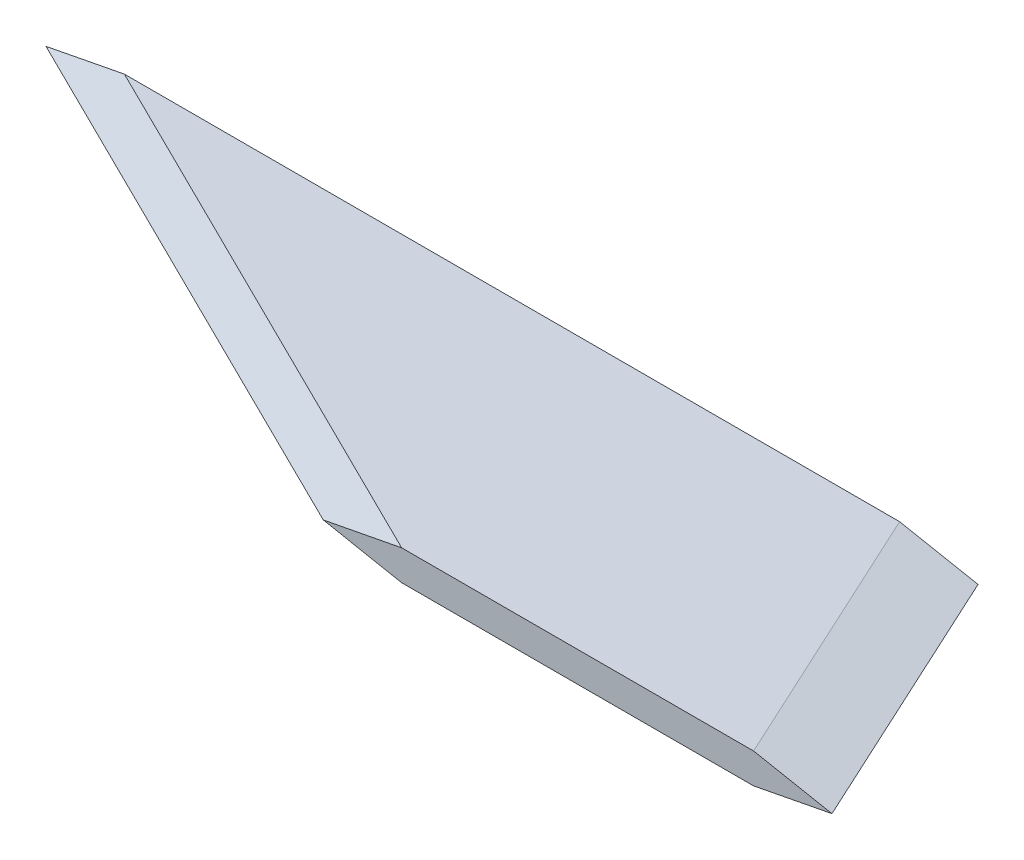
ISO-10303-21;
HEADER;
FILE_DESCRIPTION(('STEP AP214'),'2;1');
FILE_NAME('part.step','',(''),(''),'','','');
FILE_SCHEMA(('AUTOMOTIVE_DESIGN { 1 0 10303 214 1 1 1 1 }'));
ENDSEC;
DATA;
#1=APPLICATION_CONTEXT('core data for automotive mechanical design processes');
#2=APPLICATION_PROTOCOL_DEFINITION('international standard','automotive_design',2000,#1);
#3=PRODUCT_CONTEXT('',#1,'mechanical');
#4=PRODUCT('Part','Part','',(#3));
#5=PRODUCT_RELATED_PRODUCT_CATEGORY('part','',(#4));
#6=PRODUCT_DEFINITION_FORMATION('','',#4);
#7=PRODUCT_DEFINITION_CONTEXT('part definition',#1,'design');
#8=PRODUCT_DEFINITION('design','',#6,#7);
#9=PRODUCT_DEFINITION_SHAPE('','',#8);
#10=(LENGTH_UNIT() NAMED_UNIT(*) SI_UNIT(.MILLI.,.METRE.));
#11=(NAMED_UNIT(*) PLANE_ANGLE_UNIT() SI_UNIT($,.RADIAN.));
#12=(NAMED_UNIT(*) SI_UNIT($,.STERADIAN.) SOLID_ANGLE_UNIT());
#13=UNCERTAINTY_MEASURE_WITH_UNIT(LENGTH_MEASURE(1.E-05),#10,'distance_accuracy_value','');
#14=(GEOMETRIC_REPRESENTATION_CONTEXT(3) GLOBAL_UNCERTAINTY_ASSIGNED_CONTEXT((#13)) GLOBAL_UNIT_ASSIGNED_CONTEXT((#10,
#11,#12)) REPRESENTATION_CONTEXT('',''));
#15=CARTESIAN_POINT('',(0.,0.,0.));
#16=DIRECTION('',(0.,0.,1.));
#17=DIRECTION('',(1.,0.,0.));
#18=AXIS2_PLACEMENT_3D('',#15,#16,#17);
#19=CARTESIAN_POINT('',(0.,0.,43.9778671264648));
#20=DIRECTION('',(0.,0.,-1.));
#21=DIRECTION('',(-1.,0.,0.));
#22=AXIS2_PLACEMENT_3D('',#19,#20,#21);
#23=PLANE('',#22);
#24=DIRECTION('',(-0.981771529020811,-0.190064896296341,0.));
#25=VECTOR('',#24,1.);
#26=CARTESIAN_POINT('',(171.319976806641,-0.0102802654728293,43.9778671264648));
#27=LINE('',#26,#25);
#28=CARTESIAN_POINT('',(171.319976806641,-0.0102802654728293,43.9778671264648));
#29=VERTEX_POINT('',#28);
#30=CARTESIAN_POINT('',(158.620010375977,-2.46891522407532,43.9778671264648));
#31=VERTEX_POINT('',#30);
#32=EDGE_CURVE('E390',#29,#31,#27,.T.);
#33=ORIENTED_EDGE('',*,*,#32,.F.);
#34=DIRECTION('',(0.982035942360966,-0.188693953032971,0.));
#35=VECTOR('',#34,1.);
#36=CARTESIAN_POINT('',(158.619995117188,2.42996621131897,43.9778671264648));
#37=LINE('',#36,#35);
#38=CARTESIAN_POINT('',(158.619995117188,2.42996621131897,43.9778671264648));
#39=VERTEX_POINT('',#38);
#40=EDGE_CURVE('E13',#39,#29,#37,.T.);
#41=ORIENTED_EDGE('',*,*,#40,.F.);
#42=DIRECTION('',(0.999999999999918,4.05589854425458E-07,0.));
#43=VECTOR('',#42,1.);
#44=CARTESIAN_POINT('',(101.600318908691,2.4299430847168,43.9778671264648));
#45=LINE('',#44,#43);
#46=CARTESIAN_POINT('',(101.600318908691,2.4299430847168,43.9778671264648));
#47=VERTEX_POINT('',#46);
#48=EDGE_CURVE('E132',#47,#39,#45,.T.);
#49=ORIENTED_EDGE('',*,*,#48,.F.);
#50=DIRECTION('',(0.982037218923604,0.188687309188493,0.));
#51=VECTOR('',#50,1.);
#52=CARTESIAN_POINT('',(88.8999938964844,-0.0102802654728293,43.9778671264648));
#53=LINE('',#52,#51);
#54=CARTESIAN_POINT('',(88.8999938964844,-0.0102802654728293,43.9778671264648));
#55=VERTEX_POINT('',#54);
#56=EDGE_CURVE('E447',#55,#47,#53,.T.);
#57=ORIENTED_EDGE('',*,*,#56,.F.);
#58=DIRECTION('',(-0.981772530361559,0.190059723843483,0.));
#59=VECTOR('',#58,1.);
#60=CARTESIAN_POINT('',(101.600318908691,-2.46891522407532,43.9778671264648));
#61=LINE('',#60,#59);
#62=CARTESIAN_POINT('',(101.600318908691,-2.46891522407532,43.9778671264648));
#63=VERTEX_POINT('',#62);
#64=EDGE_CURVE('E279',#63,#55,#61,.T.);
#65=ORIENTED_EDGE('',*,*,#64,.F.);
#66=DIRECTION('',(-1.,0.,0.));
#67=VECTOR('',#66,1.);
#68=CARTESIAN_POINT('',(158.620010375977,-2.46891522407532,43.9778671264648));
#69=LINE('',#68,#67);
#70=EDGE_CURVE('E388',#31,#63,#69,.T.);
#71=ORIENTED_EDGE('',*,*,#70,.F.);
#72=EDGE_LOOP('',(#33,#41,#49,#57,#65,#71));
#73=FACE_BOUND('',#72,.T.);
#74=ADVANCED_FACE('F121',(#73),#23,.F.);
#75=CARTESIAN_POINT('',(2.91023767950519E-11,-1.01686476964534E-10,-5.39078256787366E-05));
#76=DIRECTION('',(5.3985439829147E-07,-1.8863026969468E-06,-0.999999999998075));
#77=DIRECTION('',(0.,0.999999999998221,-1.88630269694707E-06));
#78=AXIS2_PLACEMENT_3D('',#75,#76,#77);
#79=PLANE('',#78);
#80=DIRECTION('',(0.981802551010805,-0.18990458348309,8.88247953405389E-07));
#81=VECTOR('',#80,1.);
#82=CARTESIAN_POINT('',(138.299987792962,2.45649242403471,1.61203427303919E-05));
#83=LINE('',#82,#81);
#84=CARTESIAN_POINT('',(138.299987792962,2.45649242403471,1.61203427303919E-05));
#85=VERTEX_POINT('',#84);
#86=CARTESIAN_POINT('',(150.999999999985,5.20811692383827E-11,2.76101884631185E-05));
#87=VERTEX_POINT('',#86);
#88=EDGE_CURVE('E184',#85,#87,#83,.T.);
#89=ORIENTED_EDGE('',*,*,#88,.T.);
#90=DIRECTION('',(-0.981534850257778,-0.191283396376719,-1.69067519521798E-07));
#91=VECTOR('',#90,1.);
#92=CARTESIAN_POINT('',(150.999999999985,5.2081172934185E-11,2.76101884631185E-05));
#93=LINE('',#92,#91);
#94=CARTESIAN_POINT('',(138.299987792957,-2.47500276561449,2.54226354066225E-05));
#95=VERTEX_POINT('',#94);
#96=EDGE_CURVE('E202',#87,#95,#93,.T.);
#97=ORIENTED_EDGE('',*,*,#96,.T.);
#98=DIRECTION('',(-0.999999999999854,-1.89920538358445E-09,-5.39854394709954E-07));
#99=VECTOR('',#98,1.);
#100=CARTESIAN_POINT('',(138.299987792957,-2.47500276561449,2.54226354066225E-05));
#101=LINE('',#100,#99);
#102=CARTESIAN_POINT('',(12.7003250122299,-2.47500300415404,-4.23828945196512E-05));
#103=VERTEX_POINT('',#102);
#104=EDGE_CURVE('E352',#95,#103,#101,.T.);
#105=ORIENTED_EDGE('',*,*,#104,.T.);
#106=DIRECTION('',(-0.981535731332595,0.191278875249188,-8.90696239893344E-07));
#107=VECTOR('',#106,1.);
#108=CARTESIAN_POINT('',(12.7003250122299,-2.47500300415404,-4.23828945196512E-05));
#109=LINE('',#108,#107);
#110=CARTESIAN_POINT('',(2.91017210329869E-11,-1.01686020714808E-10,-5.39078256787366E-05));
#111=VERTEX_POINT('',#110);
#112=EDGE_CURVE('E354',#103,#111,#109,.T.);
#113=ORIENTED_EDGE('',*,*,#112,.T.);
#114=DIRECTION('',(-0.981803742332193,-0.189898424275902,-1.71825158699809E-07));
#115=VECTOR('',#114,1.);
#116=CARTESIAN_POINT('',(12.7003211975377,2.45646953573014,-5.16851465309501E-05));
#117=LINE('',#116,#115);
#118=CARTESIAN_POINT('',(12.7003211975377,2.45646953573014,-5.16851465309501E-05));
#119=VERTEX_POINT('',#118);
#120=EDGE_CURVE('E187',#119,#111,#117,.T.);
#121=ORIENTED_EDGE('',*,*,#120,.F.);
#122=DIRECTION('',(-0.999999999999838,-1.82232208019667E-07,-5.39854054547316E-07));
#123=VECTOR('',#122,1.);
#124=CARTESIAN_POINT('',(138.299987792962,2.45649242403471,1.61203427303919E-05));
#125=LINE('',#124,#123);
#126=EDGE_CURVE('E179',#85,#119,#125,.T.);
#127=ORIENTED_EDGE('',*,*,#126,.F.);
#128=EDGE_LOOP('',(#89,#97,#105,#113,#121,#127));
#129=FACE_BOUND('',#128,.T.);
#130=ADVANCED_FACE('F182',(#129),#79,.T.);
#131=CARTESIAN_POINT('',(12.7003211975377,2.45646953573014,-5.16851465309501E-05));
#132=CARTESIAN_POINT('',(42.3336537679223,2.44762738539236,14.6592545853906));
#133=CARTESIAN_POINT('',(71.9669863383068,2.43878523505458,29.3185608559277));
#134=CARTESIAN_POINT('',(101.600318908691,2.4299430847168,43.9778671264648));
#135=CARTESIAN_POINT('',(11.6419610977453,2.25176374107749,-5.18703697932657E-05));
#136=CARTESIAN_POINT('',(41.275293562166,2.24337287367421,14.6592544619084));
#137=CARTESIAN_POINT('',(70.9086260265867,2.23498200627094,29.3185607941866));
#138=CARTESIAN_POINT('',(100.541958491007,2.22659113886766,43.9778671264648));
#139=CARTESIAN_POINT('',(9.52524089816053,1.84235215177219,-5.22408163178967E-05));
#140=CARTESIAN_POINT('',(39.1585731506536,1.83486385023792,14.6592542149441));
#141=CARTESIAN_POINT('',(68.7919054031466,1.82737554870366,29.3185606707045));
#142=CARTESIAN_POINT('',(98.4252376556396,1.81988724716939,43.9778671264649));
#143=CARTESIAN_POINT('',(6.35016059878339,1.22823476781423,-5.27964861048434E-05));
#144=CARTESIAN_POINT('',(35.9834925333849,1.22210031508348,14.6592538444975));
#145=CARTESIAN_POINT('',(65.6168244679864,1.21596586235273,29.3185604854812));
#146=CARTESIAN_POINT('',(95.250156402588,1.20983140962198,43.9778671264648));
#147=CARTESIAN_POINT('',(3.17508029940624,0.614117383856271,-5.33521558917899E-05));
#148=CARTESIAN_POINT('',(32.8084119161162,0.609336779929039,14.659253474051));
#149=CARTESIAN_POINT('',(62.4417435328262,0.604556176001808,29.3185603002579));
#150=CARTESIAN_POINT('',(92.0750751495362,0.599775572074577,43.9778671264649));
#151=CARTESIAN_POINT('',(1.05836009982148,0.204705794550966,-5.3722602416421E-05));
#152=CARTESIAN_POINT('',(30.6916915046037,0.200827756492746,14.6592532270867));
#153=CARTESIAN_POINT('',(60.325022909386,0.196949718434526,29.3185601767757));
#154=CARTESIAN_POINT('',(89.9583543141683,0.193071680376306,43.9778671264648));
#155=CARTESIAN_POINT('',(2.91017210329869E-11,-1.01686454395677E-10,-5.39078256787366E-05));
#156=CARTESIAN_POINT('',(29.6333312988475,-0.00342675522540075,14.6592531036045));
#157=CARTESIAN_POINT('',(59.2666625976659,-0.00685351034911505,29.3185601150347));
#158=CARTESIAN_POINT('',(88.8999938964844,-0.0102802654728293,43.9778671264648));
#159=B_SPLINE_SURFACE_WITH_KNOTS('',3,3,((#131,#132,#133,#134),(#135,#136,#137,#138),(#139,#140,
#141,#142),(#143,#144,#145,#146),(#147,#148,#149,#150),(#151,#152,#153,#154),(#155,#156,#157,
#158)),.UNSPECIFIED.,.F.,.F.,.F.,(4,1,1,1,4),(4,4),(0.939644034283522,0.954733025712642,
0.969822017141761,0.98491100857088,1.),(0.,1.),.UNSPECIFIED.);
#160=CARTESIAN_POINT('',(2.91017210329869E-11,-1.01686020714808E-10,-5.39078256787366E-05));
#161=CARTESIAN_POINT('',(29.6333312988475,-0.00342675522540011,14.6592531036045));
#162=CARTESIAN_POINT('',(59.2666625976659,-0.00685351034911419,29.3185601150347));
#163=CARTESIAN_POINT('',(88.8999938964844,-0.0102802654728283,43.9778671264648));
#164=B_SPLINE_CURVE_WITH_KNOTS('',3,(#160,#161,#162,#163),.UNSPECIFIED.,.F.,.F.,(4,4),(0.,1.),.UNSPECIFIED.);
#165=EDGE_CURVE('E210',#111,#55,#164,.T.);
#166=CARTESIAN_POINT('',(12.7003211975377,2.45646953573014,-5.16851465309501E-05));
#167=CARTESIAN_POINT('',(42.3336537679223,2.44762738539236,14.6592545853906));
#168=CARTESIAN_POINT('',(71.9669863383068,2.43878523505458,29.3185608559277));
#169=CARTESIAN_POINT('',(101.600318908691,2.4299430847168,43.9778671264648));
#170=B_SPLINE_CURVE_WITH_KNOTS('',3,(#166,#167,#168,#169),.UNSPECIFIED.,.F.,.F.,(4,4),(0.,1.),.UNSPECIFIED.);
#171=EDGE_CURVE('E208',#119,#47,#170,.T.);
#172=ORIENTED_EDGE('',*,*,#120,.T.);
#173=ORIENTED_EDGE('',*,*,#165,.T.);
#174=ORIENTED_EDGE('',*,*,#56,.T.);
#175=ORIENTED_EDGE('',*,*,#171,.F.);
#176=EDGE_LOOP('',(#172,#173,#174,#175));
#177=FACE_BOUND('',#176,.T.);
#178=ADVANCED_FACE('F242',(#177),#159,.T.);
#179=CARTESIAN_POINT('',(138.299987792962,2.45649242403471,1.61203427303919E-05));
#180=CARTESIAN_POINT('',(145.073323567704,2.44765035312947,14.6592997890501));
#181=CARTESIAN_POINT('',(151.846659342446,2.43880828222422,29.3185834577575));
#182=CARTESIAN_POINT('',(158.619995117188,2.42996621131897,43.9778671264648));
#183=CARTESIAN_POINT('',(127.83334891001,2.456490516676,1.04698852919467E-05));
#184=CARTESIAN_POINT('',(136.511684417722,2.44764843915137,14.6592960220785));
#185=CARTESIAN_POINT('',(145.190019925434,2.43880636162675,29.3185815742717));
#186=CARTESIAN_POINT('',(153.868355433146,2.42996428410212,43.9778671264648));
#187=CARTESIAN_POINT('',(106.900071144106,2.45648670195857,-8.31029584943639E-07));
#188=CARTESIAN_POINT('',(119.388406117759,2.44764461119519,14.6592884881352));
#189=CARTESIAN_POINT('',(131.876741091411,2.43880252043181,29.3185778073));
#190=CARTESIAN_POINT('',(144.365076065064,2.42996042966843,43.9778671264649));
#191=CARTESIAN_POINT('',(75.5001544952498,2.45648097988243,-1.77824019002792E-05));
#192=CARTESIAN_POINT('',(93.703488667813,2.44763886926091,14.6592771872203));
#193=CARTESIAN_POINT('',(111.906822840376,2.4387967586394,29.3185721568426));
#194=CARTESIAN_POINT('',(130.110157012939,2.42995464801788,43.9778671264648));
#195=CARTESIAN_POINT('',(44.1002378463938,2.45647525780629,-3.47337742156146E-05));
#196=CARTESIAN_POINT('',(68.0185712178676,2.44763312732664,14.6592658863055));
#197=CARTESIAN_POINT('',(91.9369045893415,2.43879099684699,29.3185665063851));
#198=CARTESIAN_POINT('',(115.855237960815,2.42994886636734,43.9778671264648));
#199=CARTESIAN_POINT('',(23.1669600804897,2.45647144308886,-4.6034689092505E-05));
#200=CARTESIAN_POINT('',(50.895292917904,2.44762929937045,14.6592583523622));
#201=CARTESIAN_POINT('',(78.6236257553184,2.43878715565205,29.3185627394135));
#202=CARTESIAN_POINT('',(106.351958592733,2.42994501193364,43.9778671264649));
#203=CARTESIAN_POINT('',(12.7003211975377,2.45646953573014,-5.16851465309501E-05));
#204=CARTESIAN_POINT('',(42.3336537679223,2.44762738539236,14.6592545853906));
#205=CARTESIAN_POINT('',(71.9669863383068,2.43878523505458,29.3185608559277));
#206=CARTESIAN_POINT('',(101.600318908691,2.4299430847168,43.9778671264648));
#207=B_SPLINE_SURFACE_WITH_KNOTS('',3,3,((#179,#180,#181,#182),(#183,#184,#185,#186),(#187,#188,
#189,#190),(#191,#192,#193,#194),(#195,#196,#197,#198),(#199,#200,#201,#202),(#203,#204,#205,
#206)),.UNSPECIFIED.,.F.,.F.,.F.,(4,1,1,1,4),(4,4),(0.560370804845663,0.655189112205128,
0.750007419564592,0.844825726924057,0.939644034283522),(0.,1.),.UNSPECIFIED.);
#208=CARTESIAN_POINT('',(138.299987792962,2.45649242403471,1.61203427303919E-05));
#209=CARTESIAN_POINT('',(145.073323567704,2.44765035312947,14.6592997890501));
#210=CARTESIAN_POINT('',(151.846659342446,2.43880828222422,29.3185834577575));
#211=CARTESIAN_POINT('',(158.619995117188,2.42996621131897,43.9778671264648));
#212=B_SPLINE_CURVE_WITH_KNOTS('',3,(#208,#209,#210,#211),.UNSPECIFIED.,.F.,.F.,(4,4),(0.,1.),.UNSPECIFIED.);
#213=EDGE_CURVE('E201',#85,#39,#212,.T.);
#214=ORIENTED_EDGE('',*,*,#126,.T.);
#215=ORIENTED_EDGE('',*,*,#171,.T.);
#216=ORIENTED_EDGE('',*,*,#48,.T.);
#217=ORIENTED_EDGE('',*,*,#213,.F.);
#218=EDGE_LOOP('',(#214,#215,#216,#217));
#219=FACE_BOUND('',#218,.T.);
#220=ADVANCED_FACE('F206',(#219),#207,.T.);
#221=CARTESIAN_POINT('',(150.999999999985,5.20811692383827E-11,2.76101884631185E-05));
#222=CARTESIAN_POINT('',(157.773325602204,-0.00342675512288879,14.6593074489473));
#223=CARTESIAN_POINT('',(164.546651204422,-0.00685351029785875,29.3185872877061));
#224=CARTESIAN_POINT('',(171.319976806641,-0.0102802654728287,43.9778671264648));
#225=CARTESIAN_POINT('',(149.9416656494,0.204707702050633,2.66527013187247E-05));
#226=CARTESIAN_POINT('',(156.714992099329,0.200829670564807,14.6593068106225));
#227=CARTESIAN_POINT('',(163.488318549257,0.19695163907898,29.3185869685437));
#228=CARTESIAN_POINT('',(170.261644999186,0.193073607593154,43.9778671264648));
#229=CARTESIAN_POINT('',(147.82499694823,0.614123106047739,2.47377270299369E-05));
#230=CARTESIAN_POINT('',(154.598325093579,0.609342521940199,14.659305533973));
#231=CARTESIAN_POINT('',(161.371653238928,0.60456193783266,29.3185863302189));
#232=CARTESIAN_POINT('',(168.144981384277,0.59978135372512,43.9778671264648));
#233=CARTESIAN_POINT('',(144.649993896473,1.2282462120434,2.18652655967552E-05));
#234=CARTESIAN_POINT('',(151.423324584954,1.22211179900329,14.6593036189987));
#235=CARTESIAN_POINT('',(158.196655273434,1.21597738596318,29.3185853727318));
#236=CARTESIAN_POINT('',(164.969985961914,1.20984297292307,43.9778671264649));
#237=CARTESIAN_POINT('',(141.474990844718,1.84236931803906,1.89928041635735E-05));
#238=CARTESIAN_POINT('',(148.248324076329,1.83488107606638,14.6593017040244));
#239=CARTESIAN_POINT('',(155.02165730794,1.8273928340937,29.3185844152446));
#240=CARTESIAN_POINT('',(161.794990539551,1.81990459212102,43.9778671264648));
#241=CARTESIAN_POINT('',(139.358322143547,2.25178472203616,1.70778298747857E-05));
#242=CARTESIAN_POINT('',(146.131657070579,2.24339392744177,14.6593004273749));
#243=CARTESIAN_POINT('',(152.90499199761,2.23500313284738,29.3185837769199));
#244=CARTESIAN_POINT('',(159.678326924642,2.22661233825299,43.9778671264648));
#245=CARTESIAN_POINT('',(138.299987792962,2.45649242403471,1.61203427303919E-05));
#246=CARTESIAN_POINT('',(145.073323567704,2.44765035312947,14.6592997890501));
#247=CARTESIAN_POINT('',(151.846659342446,2.43880828222422,29.3185834577575));
#248=CARTESIAN_POINT('',(158.619995117188,2.42996621131897,43.9778671264648));
#249=B_SPLINE_SURFACE_WITH_KNOTS('',3,3,((#221,#222,#223,#224),(#225,#226,#227,#228),(#229,#230,
#231,#232),(#233,#234,#235,#236),(#237,#238,#239,#240),(#241,#242,#243,#244),(#245,#246,#247,
#248)),.UNSPECIFIED.,.F.,.F.,.F.,(4,1,1,1,4),(4,4),(0.500016336385516,0.515104953500553,
0.53019357061559,0.545282187730626,0.560370804845663),(0.,1.),.UNSPECIFIED.);
#250=CARTESIAN_POINT('',(150.999999999985,5.20811692383827E-11,2.76101884631185E-05));
#251=CARTESIAN_POINT('',(157.773325602204,-0.00342675512288879,14.6593074489473));
#252=CARTESIAN_POINT('',(164.546651204422,-0.00685351029785875,29.3185872877061));
#253=CARTESIAN_POINT('',(171.319976806641,-0.0102802654728287,43.9778671264648));
#254=B_SPLINE_CURVE_WITH_KNOTS('',3,(#250,#251,#252,#253),.UNSPECIFIED.,.F.,.F.,(4,4),(0.,1.),.UNSPECIFIED.);
#255=EDGE_CURVE('E140',#87,#29,#254,.T.);
#256=ORIENTED_EDGE('',*,*,#88,.F.);
#257=ORIENTED_EDGE('',*,*,#213,.T.);
#258=ORIENTED_EDGE('',*,*,#40,.T.);
#259=ORIENTED_EDGE('',*,*,#255,.F.);
#260=EDGE_LOOP('',(#256,#257,#258,#259));
#261=FACE_BOUND('',#260,.T.);
#262=ADVANCED_FACE('F200',(#261),#249,.T.);
#263=CARTESIAN_POINT('',(138.299987792957,-2.47500276561449,2.54226354066225E-05));
#264=CARTESIAN_POINT('',(145.073328653964,-2.47297358510143,14.6593059905786));
#265=CARTESIAN_POINT('',(151.84666951497,-2.47094440458837,29.3185865585217));
#266=CARTESIAN_POINT('',(158.620010375977,-2.46891522407532,43.9778671264648));
#267=CARTESIAN_POINT('',(139.358322143543,-2.26875253514227,2.56049314946638E-05));
#268=CARTESIAN_POINT('',(146.131661732984,-2.26717801593655,14.6593061121093));
#269=CARTESIAN_POINT('',(152.905001322424,-2.26560349673083,29.3185866192871));
#270=CARTESIAN_POINT('',(159.678340911865,-2.26402897752511,43.9778671264648));
#271=CARTESIAN_POINT('',(141.474990844714,-1.85625207419785,2.59695236707465E-05));
#272=CARTESIAN_POINT('',(148.248327891023,-1.8555868776068,14.6593063551707));
#273=CARTESIAN_POINT('',(155.021664937333,-1.85492168101575,29.3185867408178));
#274=CARTESIAN_POINT('',(161.795001983642,-1.8542564844247,43.9778671264648));
#275=CARTESIAN_POINT('',(144.649993896471,-1.2375013827812,2.65164119348705E-05));
#276=CARTESIAN_POINT('',(151.423327128084,-1.23820017011216,14.6593067197629));
#277=CARTESIAN_POINT('',(158.196660359696,-1.23889895744312,29.3185869231139));
#278=CARTESIAN_POINT('',(164.969993591309,-1.23959774477407,43.9778671264649));
#279=CARTESIAN_POINT('',(147.824996948228,-0.618750691364561,2.70633001989945E-05));
#280=CARTESIAN_POINT('',(154.598326365143,-0.620813462617524,14.6593070843551));
#281=CARTESIAN_POINT('',(161.371655782059,-0.622876233870488,29.3185871054099));
#282=CARTESIAN_POINT('',(168.144985198974,-0.624939005123451,43.9778671264648));
#283=CARTESIAN_POINT('',(149.941665649399,-0.206250230420133,2.74278923750772E-05));
#284=CARTESIAN_POINT('',(156.714992523184,-0.209222324287767,14.6593073274165));
#285=CARTESIAN_POINT('',(163.488319396968,-0.212194418155402,29.3185872269407));
#286=CARTESIAN_POINT('',(170.261646270752,-0.215166512023037,43.9778671264648));
#287=CARTESIAN_POINT('',(150.999999999985,5.20811692383827E-11,2.76101884631185E-05));
#288=CARTESIAN_POINT('',(157.773325602204,-0.00342675512288879,14.6593074489473));
#289=CARTESIAN_POINT('',(164.546651204422,-0.00685351029785875,29.3185872877061));
#290=CARTESIAN_POINT('',(171.319976806641,-0.0102802654728287,43.9778671264648));
#291=B_SPLINE_SURFACE_WITH_KNOTS('',3,3,((#263,#264,#265,#266),(#267,#268,#269,#270),(#271,#272,
#273,#274),(#275,#276,#277,#278),(#279,#280,#281,#282),(#283,#284,#285,#286),(#287,#288,#289,
#290)),.UNSPECIFIED.,.F.,.F.,.F.,(4,1,1,1,4),(4,4),(0.439645587084536,0.454738274409781,
0.469830961735026,0.484923649060271,0.500016336385516),(0.,1.),.UNSPECIFIED.);
#292=CARTESIAN_POINT('',(138.299987792957,-2.47500276561449,2.54226354066225E-05));
#293=CARTESIAN_POINT('',(145.073328653964,-2.47297358510143,14.6593059905786));
#294=CARTESIAN_POINT('',(151.84666951497,-2.47094440458837,29.3185865585217));
#295=CARTESIAN_POINT('',(158.620010375977,-2.46891522407532,43.9778671264648));
#296=B_SPLINE_CURVE_WITH_KNOTS('',3,(#292,#293,#294,#295),.UNSPECIFIED.,.F.,.F.,(4,4),(0.,1.),.UNSPECIFIED.);
#297=EDGE_CURVE('E212',#95,#31,#296,.T.);
#298=ORIENTED_EDGE('',*,*,#96,.F.);
#299=ORIENTED_EDGE('',*,*,#255,.T.);
#300=ORIENTED_EDGE('',*,*,#32,.T.);
#301=ORIENTED_EDGE('',*,*,#297,.F.);
#302=EDGE_LOOP('',(#298,#299,#300,#301));
#303=FACE_BOUND('',#302,.T.);
#304=ADVANCED_FACE('F298',(#303),#291,.T.);
#305=CARTESIAN_POINT('',(12.7003250122299,-2.47500300415404,-4.23828945196512E-05));
#306=DIRECTION('',(1.82447632254304E-09,-0.999999990419336,0.00013842444746431));
#307=DIRECTION('',(0.999999999999854,1.89920538703733E-09,5.39854394709954E-07));
#308=AXIS2_PLACEMENT_3D('',#305,#306,#307);
#309=PLANE('',#308);
#310=ORIENTED_EDGE('',*,*,#104,.F.);
#311=ORIENTED_EDGE('',*,*,#297,.T.);
#312=ORIENTED_EDGE('',*,*,#70,.T.);
#313=CARTESIAN_POINT('',(12.7003250122299,-2.47500300415404,-4.23828945196512E-05));
#314=CARTESIAN_POINT('',(42.3336563110504,-2.4729737441278,14.6592607868919));
#315=CARTESIAN_POINT('',(71.9669876098709,-2.47094448410156,29.3185639566784));
#316=CARTESIAN_POINT('',(101.600318908691,-2.46891522407532,43.9778671264648));
#317=B_SPLINE_CURVE_WITH_KNOTS('',3,(#313,#314,#315,#316),.UNSPECIFIED.,.F.,.F.,(4,4),(0.,1.),.UNSPECIFIED.);
#318=EDGE_CURVE('E193',#103,#63,#317,.T.);
#319=ORIENTED_EDGE('',*,*,#318,.F.);
#320=EDGE_LOOP('',(#310,#311,#312,#319));
#321=FACE_BOUND('',#320,.T.);
#322=ADVANCED_FACE('F123',(#321),#309,.T.);
#323=CARTESIAN_POINT('',(2.91017210329869E-11,-1.01686020714808E-10,-5.39078256787366E-05));
#324=CARTESIAN_POINT('',(29.6333312988475,-0.00342675522540011,14.6592531036045));
#325=CARTESIAN_POINT('',(59.2666625976659,-0.00685351034911419,29.3185601150347));
#326=CARTESIAN_POINT('',(88.8999938964844,-0.0102802654728283,43.9778671264648));
#327=CARTESIAN_POINT('',(1.0583604177125,-0.206250250439383,-5.29474147488128E-05));
#328=CARTESIAN_POINT('',(30.6916917165311,-0.209222337633934,14.6592537438784));
#329=CARTESIAN_POINT('',(60.3250230153497,-0.212194424828485,29.3185604351716));
#330=CARTESIAN_POINT('',(89.9583543141683,-0.215166512023036,43.9778671264648));
#331=CARTESIAN_POINT('',(3.1750812530793,-0.618750751114775,-5.10265928889652E-05));
#332=CARTESIAN_POINT('',(32.8084125518982,-0.620813502451,14.6592550244264));
#333=CARTESIAN_POINT('',(62.4417438507172,-0.622876253787225,29.3185610754456));
#334=CARTESIAN_POINT('',(92.0750751495361,-0.62493900512345,43.9778671264648));
#335=CARTESIAN_POINT('',(6.35016250612951,-1.23750150212787,-4.8145360099194E-05));
#336=CARTESIAN_POINT('',(35.983493804949,-1.2382002496766,14.6592569452482));
#337=CARTESIAN_POINT('',(65.6168251037685,-1.23889899722534,29.3185620358565));
#338=CARTESIAN_POINT('',(95.2501564025879,-1.23959774477407,43.9778671264649));
#339=CARTESIAN_POINT('',(9.52524375917971,-1.85625225314095,-4.52641273094225E-05));
#340=CARTESIAN_POINT('',(39.1585750579997,-1.8555869969022,14.6592588660701));
#341=CARTESIAN_POINT('',(68.7919063568197,-1.85492174066345,29.3185629962675));
#342=CARTESIAN_POINT('',(98.4252376556397,-1.85425648442469,43.9778671264648));
#343=CARTESIAN_POINT('',(11.6419645945465,-2.26875275381635,-4.3343305449575E-05));
#344=CARTESIAN_POINT('',(41.2752958933668,-2.26717816171927,14.659260146618));
#345=CARTESIAN_POINT('',(70.9086271921872,-2.26560356962219,29.3185636365414));
#346=CARTESIAN_POINT('',(100.541958491007,-2.26402897752511,43.9778671264648));
#347=CARTESIAN_POINT('',(12.7003250122299,-2.47500300415404,-4.23828945196512E-05));
#348=CARTESIAN_POINT('',(42.3336563110504,-2.4729737441278,14.6592607868919));
#349=CARTESIAN_POINT('',(71.9669876098709,-2.47094448410156,29.3185639566784));
#350=CARTESIAN_POINT('',(101.600318908691,-2.46891522407532,43.9778671264648));
#351=B_SPLINE_SURFACE_WITH_KNOTS('',3,3,((#323,#324,#325,#326),(#327,#328,#329,#330),(#331,#332,
#333,#334),(#335,#336,#337,#338),(#339,#340,#341,#342),(#343,#344,#345,#346),(#347,#348,#349,
#350)),.UNSPECIFIED.,.F.,.F.,.F.,(4,1,1,1,4),(4,4),(0.,0.0150930794800955,0.0301861589601909,
0.0452792384402864,0.0603723179203818),(0.,1.),.UNSPECIFIED.);
#352=ORIENTED_EDGE('',*,*,#112,.F.);
#353=ORIENTED_EDGE('',*,*,#318,.T.);
#354=ORIENTED_EDGE('',*,*,#64,.T.);
#355=ORIENTED_EDGE('',*,*,#165,.F.);
#356=EDGE_LOOP('',(#352,#353,#354,#355));
#357=FACE_BOUND('',#356,.T.);
#358=ADVANCED_FACE('F285',(#357),#351,.T.);
#359=CLOSED_SHELL('',(#74,#130,#178,#220,#262,#304,#322,#358));
#360=MANIFOLD_SOLID_BREP('B2',#359);
#361=ADVANCED_BREP_SHAPE_REPRESENTATION('',(#18,#360),#14);
#362=SHAPE_DEFINITION_REPRESENTATION(#9,#361);
ENDSEC;
END-ISO-10303-21;
